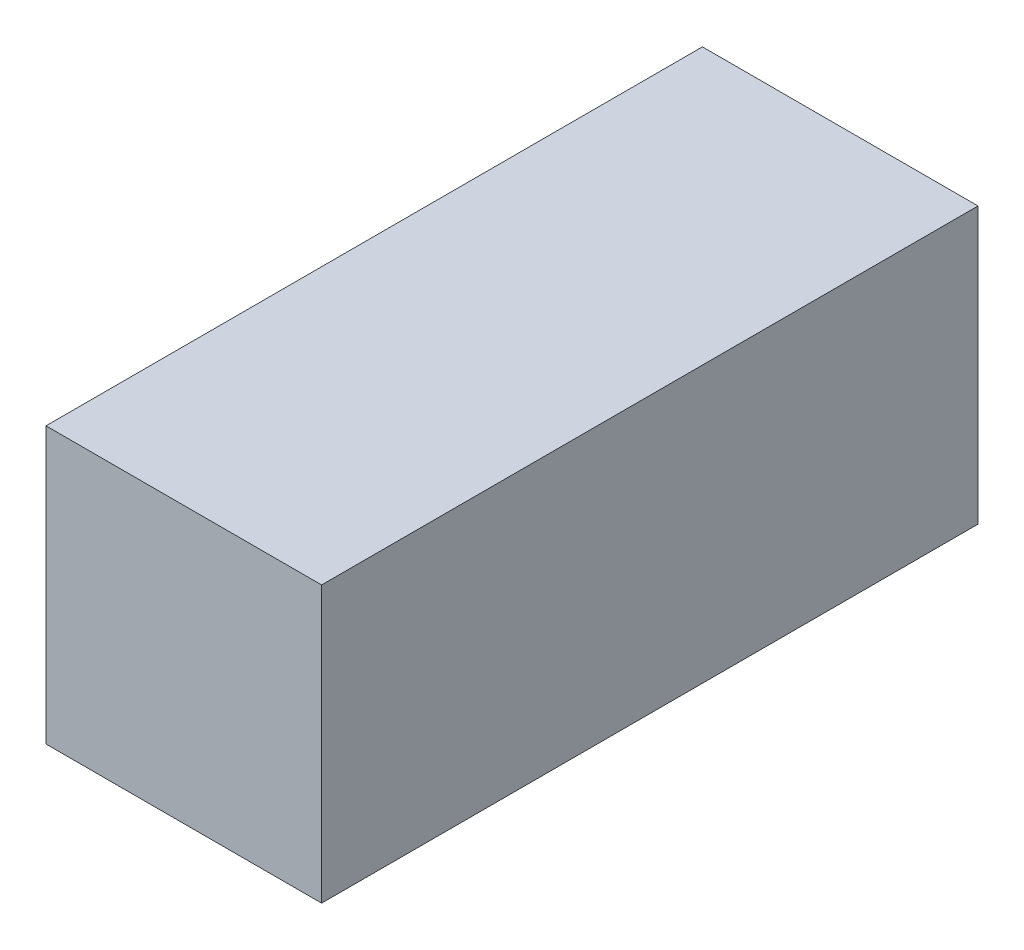
ISO-10303-21;
HEADER;
FILE_DESCRIPTION(('STEP AP214'),'2;1');
FILE_NAME('part.step','',(''),(''),'','','');
FILE_SCHEMA(('AUTOMOTIVE_DESIGN { 1 0 10303 214 1 1 1 1 }'));
ENDSEC;
DATA;
#1=APPLICATION_CONTEXT('core data for automotive mechanical design processes');
#2=APPLICATION_PROTOCOL_DEFINITION('international standard','automotive_design',2000,#1);
#3=PRODUCT_CONTEXT('',#1,'mechanical');
#4=PRODUCT('Part','Part','',(#3));
#5=PRODUCT_RELATED_PRODUCT_CATEGORY('part','',(#4));
#6=PRODUCT_DEFINITION_FORMATION('','',#4);
#7=PRODUCT_DEFINITION_CONTEXT('part definition',#1,'design');
#8=PRODUCT_DEFINITION('design','',#6,#7);
#9=PRODUCT_DEFINITION_SHAPE('','',#8);
#10=(LENGTH_UNIT() NAMED_UNIT(*) SI_UNIT(.MILLI.,.METRE.));
#11=(NAMED_UNIT(*) PLANE_ANGLE_UNIT() SI_UNIT($,.RADIAN.));
#12=(NAMED_UNIT(*) SI_UNIT($,.STERADIAN.) SOLID_ANGLE_UNIT());
#13=UNCERTAINTY_MEASURE_WITH_UNIT(LENGTH_MEASURE(1.E-05),#10,'distance_accuracy_value','');
#14=(GEOMETRIC_REPRESENTATION_CONTEXT(3) GLOBAL_UNCERTAINTY_ASSIGNED_CONTEXT((#13)) GLOBAL_UNIT_ASSIGNED_CONTEXT((#10,
#11,#12)) REPRESENTATION_CONTEXT('',''));
#15=CARTESIAN_POINT('',(0.,0.,0.));
#16=DIRECTION('',(0.,0.,1.));
#17=DIRECTION('',(1.,0.,0.));
#18=AXIS2_PLACEMENT_3D('',#15,#16,#17);
#19=CARTESIAN_POINT('',(33.587572106361,-33.587572106361,160.));
#20=DIRECTION('',(-1.,0.,0.));
#21=DIRECTION('',(0.,-1.,0.));
#22=AXIS2_PLACEMENT_3D('',#19,#20,#21);
#23=PLANE('',#22);
#24=DIRECTION('',(0.,1.,0.));
#25=VECTOR('',#24,1.);
#26=CARTESIAN_POINT('',(33.587572106361,-33.587572106361,0.));
#27=LINE('',#26,#25);
#28=CARTESIAN_POINT('',(33.587572106361,-33.587572106361,0.));
#29=VERTEX_POINT('',#28);
#30=CARTESIAN_POINT('',(33.587572106361,33.587572106361,0.));
#31=VERTEX_POINT('',#30);
#32=EDGE_CURVE('E96',#29,#31,#27,.T.);
#33=ORIENTED_EDGE('',*,*,#32,.T.);
#34=DIRECTION('',(0.,0.,-1.));
#35=VECTOR('',#34,1.);
#36=CARTESIAN_POINT('',(33.587572106361,33.587572106361,160.));
#37=LINE('',#36,#35);
#38=CARTESIAN_POINT('',(33.587572106361,33.587572106361,160.));
#39=VERTEX_POINT('',#38);
#40=EDGE_CURVE('E11',#39,#31,#37,.T.);
#41=ORIENTED_EDGE('',*,*,#40,.F.);
#42=DIRECTION('',(0.,1.,0.));
#43=VECTOR('',#42,1.);
#44=CARTESIAN_POINT('',(33.587572106361,-33.587572106361,160.));
#45=LINE('',#44,#43);
#46=CARTESIAN_POINT('',(33.587572106361,-33.587572106361,160.));
#47=VERTEX_POINT('',#46);
#48=EDGE_CURVE('E84',#47,#39,#45,.T.);
#49=ORIENTED_EDGE('',*,*,#48,.F.);
#50=DIRECTION('',(0.,0.,-1.));
#51=VECTOR('',#50,1.);
#52=CARTESIAN_POINT('',(33.587572106361,-33.587572106361,160.));
#53=LINE('',#52,#51);
#54=EDGE_CURVE('E92',#47,#29,#53,.T.);
#55=ORIENTED_EDGE('',*,*,#54,.T.);
#56=EDGE_LOOP('',(#33,#41,#49,#55));
#57=FACE_BOUND('',#56,.T.);
#58=ADVANCED_FACE('F33',(#57),#23,.F.);
#59=CARTESIAN_POINT('',(33.587572106361,33.587572106361,160.));
#60=DIRECTION('',(0.,-1.,0.));
#61=DIRECTION('',(1.,0.,0.));
#62=AXIS2_PLACEMENT_3D('',#59,#60,#61);
#63=PLANE('',#62);
#64=DIRECTION('',(-1.,0.,0.));
#65=VECTOR('',#64,1.);
#66=CARTESIAN_POINT('',(33.587572106361,33.587572106361,0.));
#67=LINE('',#66,#65);
#68=CARTESIAN_POINT('',(-33.587572106361,33.587572106361,0.));
#69=VERTEX_POINT('',#68);
#70=EDGE_CURVE('E88',#31,#69,#67,.T.);
#71=ORIENTED_EDGE('',*,*,#70,.T.);
#72=DIRECTION('',(0.,0.,-1.));
#73=VECTOR('',#72,1.);
#74=CARTESIAN_POINT('',(-33.587572106361,33.587572106361,160.));
#75=LINE('',#74,#73);
#76=CARTESIAN_POINT('',(-33.587572106361,33.587572106361,160.));
#77=VERTEX_POINT('',#76);
#78=EDGE_CURVE('E41',#77,#69,#75,.T.);
#79=ORIENTED_EDGE('',*,*,#78,.F.);
#80=DIRECTION('',(-1.,0.,0.));
#81=VECTOR('',#80,1.);
#82=CARTESIAN_POINT('',(33.587572106361,33.587572106361,160.));
#83=LINE('',#82,#81);
#84=EDGE_CURVE('E79',#39,#77,#83,.T.);
#85=ORIENTED_EDGE('',*,*,#84,.F.);
#86=ORIENTED_EDGE('',*,*,#40,.T.);
#87=EDGE_LOOP('',(#71,#79,#85,#86));
#88=FACE_BOUND('',#87,.T.);
#89=ADVANCED_FACE('F87',(#88),#63,.F.);
#90=CARTESIAN_POINT('',(-33.587572106361,33.587572106361,160.));
#91=DIRECTION('',(1.,0.,0.));
#92=DIRECTION('',(0.,1.,0.));
#93=AXIS2_PLACEMENT_3D('',#90,#91,#92);
#94=PLANE('',#93);
#95=DIRECTION('',(0.,-1.,0.));
#96=VECTOR('',#95,1.);
#97=CARTESIAN_POINT('',(-33.587572106361,33.587572106361,0.));
#98=LINE('',#97,#96);
#99=CARTESIAN_POINT('',(-33.587572106361,-33.587572106361,0.));
#100=VERTEX_POINT('',#99);
#101=EDGE_CURVE('E66',#69,#100,#98,.T.);
#102=ORIENTED_EDGE('',*,*,#101,.T.);
#103=DIRECTION('',(0.,0.,-1.));
#104=VECTOR('',#103,1.);
#105=CARTESIAN_POINT('',(-33.587572106361,-33.587572106361,160.));
#106=LINE('',#105,#104);
#107=CARTESIAN_POINT('',(-33.587572106361,-33.587572106361,160.));
#108=VERTEX_POINT('',#107);
#109=EDGE_CURVE('E89',#108,#100,#106,.T.);
#110=ORIENTED_EDGE('',*,*,#109,.F.);
#111=DIRECTION('',(0.,-1.,0.));
#112=VECTOR('',#111,1.);
#113=CARTESIAN_POINT('',(-33.587572106361,33.587572106361,160.));
#114=LINE('',#113,#112);
#115=EDGE_CURVE('E82',#77,#108,#114,.T.);
#116=ORIENTED_EDGE('',*,*,#115,.F.);
#117=ORIENTED_EDGE('',*,*,#78,.T.);
#118=EDGE_LOOP('',(#102,#110,#116,#117));
#119=FACE_BOUND('',#118,.T.);
#120=ADVANCED_FACE('F90',(#119),#94,.F.);
#121=CARTESIAN_POINT('',(-33.587572106361,-33.587572106361,160.));
#122=DIRECTION('',(0.,1.,0.));
#123=DIRECTION('',(-1.,0.,0.));
#124=AXIS2_PLACEMENT_3D('',#121,#122,#123);
#125=PLANE('',#124);
#126=DIRECTION('',(1.,0.,0.));
#127=VECTOR('',#126,1.);
#128=CARTESIAN_POINT('',(-33.587572106361,-33.587572106361,0.));
#129=LINE('',#128,#127);
#130=EDGE_CURVE('E72',#100,#29,#129,.T.);
#131=ORIENTED_EDGE('',*,*,#130,.T.);
#132=ORIENTED_EDGE('',*,*,#54,.F.);
#133=DIRECTION('',(1.,0.,0.));
#134=VECTOR('',#133,1.);
#135=CARTESIAN_POINT('',(-33.587572106361,-33.587572106361,160.));
#136=LINE('',#135,#134);
#137=EDGE_CURVE('E49',#108,#47,#136,.T.);
#138=ORIENTED_EDGE('',*,*,#137,.F.);
#139=ORIENTED_EDGE('',*,*,#109,.T.);
#140=EDGE_LOOP('',(#131,#132,#138,#139));
#141=FACE_BOUND('',#140,.T.);
#142=ADVANCED_FACE('F103',(#141),#125,.F.);
#143=CARTESIAN_POINT('',(0.,0.,160.));
#144=DIRECTION('',(0.,0.,1.));
#145=DIRECTION('',(1.,0.,0.));
#146=AXIS2_PLACEMENT_3D('',#143,#144,#145);
#147=PLANE('',#146);
#148=ORIENTED_EDGE('',*,*,#48,.T.);
#149=ORIENTED_EDGE('',*,*,#84,.T.);
#150=ORIENTED_EDGE('',*,*,#115,.T.);
#151=ORIENTED_EDGE('',*,*,#137,.T.);
#152=EDGE_LOOP('',(#148,#149,#150,#151));
#153=FACE_BOUND('',#152,.T.);
#154=ADVANCED_FACE('F80',(#153),#147,.T.);
#155=CARTESIAN_POINT('',(0.,0.,0.));
#156=DIRECTION('',(0.,0.,1.));
#157=DIRECTION('',(1.,0.,0.));
#158=AXIS2_PLACEMENT_3D('',#155,#156,#157);
#159=PLANE('',#158);
#160=ORIENTED_EDGE('',*,*,#32,.F.);
#161=ORIENTED_EDGE('',*,*,#130,.F.);
#162=ORIENTED_EDGE('',*,*,#101,.F.);
#163=ORIENTED_EDGE('',*,*,#70,.F.);
#164=EDGE_LOOP('',(#160,#161,#162,#163));
#165=FACE_BOUND('',#164,.T.);
#166=ADVANCED_FACE('F106',(#165),#159,.F.);
#167=CLOSED_SHELL('',(#58,#89,#120,#142,#154,#166));
#168=MANIFOLD_SOLID_BREP('B2',#167);
#169=ADVANCED_BREP_SHAPE_REPRESENTATION('',(#18,#168),#14);
#170=SHAPE_DEFINITION_REPRESENTATION(#9,#169);
ENDSEC;
END-ISO-10303-21;
